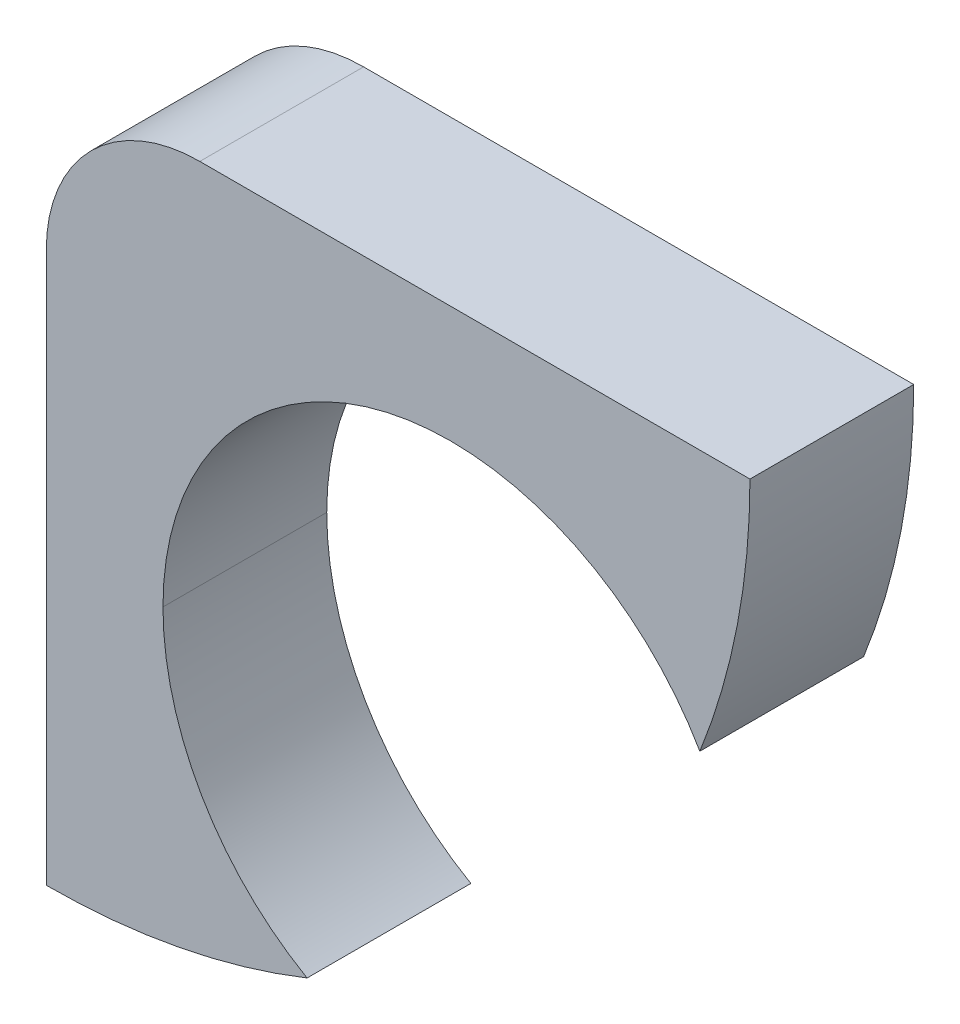
ISO-10303-21;
HEADER;
FILE_DESCRIPTION(('STEP AP214'),'2;1');
FILE_NAME('part.step','',(''),(''),'','','');
FILE_SCHEMA(('AUTOMOTIVE_DESIGN { 1 0 10303 214 1 1 1 1 }'));
ENDSEC;
DATA;
#1=APPLICATION_CONTEXT('core data for automotive mechanical design processes');
#2=APPLICATION_PROTOCOL_DEFINITION('international standard','automotive_design',2000,#1);
#3=PRODUCT_CONTEXT('',#1,'mechanical');
#4=PRODUCT('Part','Part','',(#3));
#5=PRODUCT_RELATED_PRODUCT_CATEGORY('part','',(#4));
#6=PRODUCT_DEFINITION_FORMATION('','',#4);
#7=PRODUCT_DEFINITION_CONTEXT('part definition',#1,'design');
#8=PRODUCT_DEFINITION('design','',#6,#7);
#9=PRODUCT_DEFINITION_SHAPE('','',#8);
#10=(LENGTH_UNIT() NAMED_UNIT(*) SI_UNIT(.MILLI.,.METRE.));
#11=(NAMED_UNIT(*) PLANE_ANGLE_UNIT() SI_UNIT($,.RADIAN.));
#12=(NAMED_UNIT(*) SI_UNIT($,.STERADIAN.) SOLID_ANGLE_UNIT());
#13=UNCERTAINTY_MEASURE_WITH_UNIT(LENGTH_MEASURE(1.E-05),#10,'distance_accuracy_value','');
#14=(GEOMETRIC_REPRESENTATION_CONTEXT(3) GLOBAL_UNCERTAINTY_ASSIGNED_CONTEXT((#13)) GLOBAL_UNIT_ASSIGNED_CONTEXT((#10,
#11,#12)) REPRESENTATION_CONTEXT('',''));
#15=CARTESIAN_POINT('',(0.,0.,0.));
#16=DIRECTION('',(0.,0.,1.));
#17=DIRECTION('',(1.,0.,0.));
#18=AXIS2_PLACEMENT_3D('',#15,#16,#17);
#19=CARTESIAN_POINT('',(-19.95,19.95,18.95));
#20=DIRECTION('',(0.,0.,1.));
#21=DIRECTION('',(1.,0.,0.));
#22=AXIS2_PLACEMENT_3D('',#19,#20,#21);
#23=PLANE('',#22);
#24=CARTESIAN_POINT('',(-19.95,19.95,18.95));
#25=DIRECTION('',(0.,0.,1.));
#26=DIRECTION('',(1.,0.,0.));
#27=AXIS2_PLACEMENT_3D('',#24,#25,#26);
#28=CIRCLE('',#27,6.875);
#29=CARTESIAN_POINT('',(-13.5646574803851,17.4018583423997,18.95));
#30=VERTEX_POINT('',#29);
#31=CARTESIAN_POINT('',(-13.075,19.95,18.95));
#32=VERTEX_POINT('',#31);
#33=EDGE_CURVE('E148',#30,#32,#28,.T.);
#34=ORIENTED_EDGE('',*,*,#33,.F.);
#35=CARTESIAN_POINT('',(-16.,16.,18.95));
#36=DIRECTION('',(0.,0.,-1.));
#37=DIRECTION('',(1.,0.,0.));
#38=AXIS2_PLACEMENT_3D('',#35,#36,#37);
#39=CIRCLE('',#38,2.81);
#40=CARTESIAN_POINT('',(-18.81,16.,18.95));
#41=VERTEX_POINT('',#40);
#42=EDGE_CURVE('E142',#41,#30,#39,.T.);
#43=ORIENTED_EDGE('',*,*,#42,.F.);
#44=CARTESIAN_POINT('',(-16.,16.,18.95));
#45=DIRECTION('',(0.,0.,-1.));
#46=DIRECTION('',(1.,0.,0.));
#47=AXIS2_PLACEMENT_3D('',#44,#45,#46);
#48=CIRCLE('',#47,2.81);
#49=CARTESIAN_POINT('',(-17.4018583423997,13.5646574803851,18.95));
#50=VERTEX_POINT('',#49);
#51=EDGE_CURVE('E11',#50,#41,#48,.T.);
#52=ORIENTED_EDGE('',*,*,#51,.F.);
#53=CARTESIAN_POINT('',(-19.95,19.95,18.95));
#54=DIRECTION('',(0.,0.,1.));
#55=DIRECTION('',(1.,0.,0.));
#56=AXIS2_PLACEMENT_3D('',#53,#54,#55);
#57=CIRCLE('',#56,6.875);
#58=CARTESIAN_POINT('',(-19.95,13.075,18.95));
#59=VERTEX_POINT('',#58);
#60=EDGE_CURVE('E102',#59,#50,#57,.T.);
#61=ORIENTED_EDGE('',*,*,#60,.F.);
#62=DIRECTION('',(0.,-1.,0.));
#63=VECTOR('',#62,1.);
#64=CARTESIAN_POINT('',(-19.95,18.45,18.95));
#65=LINE('',#64,#63);
#66=CARTESIAN_POINT('',(-19.95,18.45,18.95));
#67=VERTEX_POINT('',#66);
#68=EDGE_CURVE('E96',#67,#59,#65,.T.);
#69=ORIENTED_EDGE('',*,*,#68,.F.);
#70=CARTESIAN_POINT('',(-18.45,18.45,18.95));
#71=DIRECTION('',(0.,0.,1.));
#72=DIRECTION('',(1.,0.,0.));
#73=AXIS2_PLACEMENT_3D('',#70,#71,#72);
#74=CIRCLE('',#73,1.5);
#75=CARTESIAN_POINT('',(-18.45,19.95,18.95));
#76=VERTEX_POINT('',#75);
#77=EDGE_CURVE('E99',#76,#67,#74,.T.);
#78=ORIENTED_EDGE('',*,*,#77,.F.);
#79=DIRECTION('',(-1.,0.,0.));
#80=VECTOR('',#79,1.);
#81=CARTESIAN_POINT('',(-13.075,19.95,18.95));
#82=LINE('',#81,#80);
#83=EDGE_CURVE('E20',#32,#76,#82,.T.);
#84=ORIENTED_EDGE('',*,*,#83,.F.);
#85=EDGE_LOOP('',(#34,#43,#52,#61,#69,#78,#84));
#86=FACE_BOUND('',#85,.T.);
#87=ADVANCED_FACE('F16',(#86),#23,.F.);
#88=CARTESIAN_POINT('',(-19.95,19.95,20.55));
#89=DIRECTION('',(0.,0.,1.));
#90=DIRECTION('',(1.,0.,0.));
#91=AXIS2_PLACEMENT_3D('',#88,#89,#90);
#92=PLANE('',#91);
#93=CARTESIAN_POINT('',(-19.95,19.95,20.55));
#94=DIRECTION('',(0.,0.,1.));
#95=DIRECTION('',(1.,0.,0.));
#96=AXIS2_PLACEMENT_3D('',#93,#94,#95);
#97=CIRCLE('',#96,6.875);
#98=CARTESIAN_POINT('',(-13.5646574803851,17.4018583423997,20.55));
#99=VERTEX_POINT('',#98);
#100=CARTESIAN_POINT('',(-13.075,19.95,20.55));
#101=VERTEX_POINT('',#100);
#102=EDGE_CURVE('E158',#99,#101,#97,.T.);
#103=ORIENTED_EDGE('',*,*,#102,.T.);
#104=DIRECTION('',(-1.,0.,0.));
#105=VECTOR('',#104,1.);
#106=CARTESIAN_POINT('',(-13.075,19.95,20.55));
#107=LINE('',#106,#105);
#108=CARTESIAN_POINT('',(-18.45,19.95,20.55));
#109=VERTEX_POINT('',#108);
#110=EDGE_CURVE('E124',#101,#109,#107,.T.);
#111=ORIENTED_EDGE('',*,*,#110,.T.);
#112=CARTESIAN_POINT('',(-18.45,18.45,20.55));
#113=DIRECTION('',(0.,0.,1.));
#114=DIRECTION('',(1.,0.,0.));
#115=AXIS2_PLACEMENT_3D('',#112,#113,#114);
#116=CIRCLE('',#115,1.5);
#117=CARTESIAN_POINT('',(-19.95,18.45,20.55));
#118=VERTEX_POINT('',#117);
#119=EDGE_CURVE('E108',#109,#118,#116,.T.);
#120=ORIENTED_EDGE('',*,*,#119,.T.);
#121=DIRECTION('',(0.,-1.,0.));
#122=VECTOR('',#121,1.);
#123=CARTESIAN_POINT('',(-19.95,18.45,20.55));
#124=LINE('',#123,#122);
#125=CARTESIAN_POINT('',(-19.95,13.075,20.55));
#126=VERTEX_POINT('',#125);
#127=EDGE_CURVE('E114',#118,#126,#124,.T.);
#128=ORIENTED_EDGE('',*,*,#127,.T.);
#129=CARTESIAN_POINT('',(-19.95,19.95,20.55));
#130=DIRECTION('',(0.,0.,1.));
#131=DIRECTION('',(1.,0.,0.));
#132=AXIS2_PLACEMENT_3D('',#129,#130,#131);
#133=CIRCLE('',#132,6.875);
#134=CARTESIAN_POINT('',(-17.4018583423997,13.5646574803851,20.55));
#135=VERTEX_POINT('',#134);
#136=EDGE_CURVE('E135',#126,#135,#133,.T.);
#137=ORIENTED_EDGE('',*,*,#136,.T.);
#138=CARTESIAN_POINT('',(-16.,16.,20.55));
#139=DIRECTION('',(0.,0.,-1.));
#140=DIRECTION('',(1.,0.,0.));
#141=AXIS2_PLACEMENT_3D('',#138,#139,#140);
#142=CIRCLE('',#141,2.81);
#143=CARTESIAN_POINT('',(-18.81,16.,20.55));
#144=VERTEX_POINT('',#143);
#145=EDGE_CURVE('E26',#135,#144,#142,.T.);
#146=ORIENTED_EDGE('',*,*,#145,.T.);
#147=CARTESIAN_POINT('',(-16.,16.,20.55));
#148=DIRECTION('',(0.,0.,-1.));
#149=DIRECTION('',(1.,0.,0.));
#150=AXIS2_PLACEMENT_3D('',#147,#148,#149);
#151=CIRCLE('',#150,2.81);
#152=EDGE_CURVE('E143',#144,#99,#151,.T.);
#153=ORIENTED_EDGE('',*,*,#152,.T.);
#154=EDGE_LOOP('',(#103,#111,#120,#128,#137,#146,#153));
#155=FACE_BOUND('',#154,.T.);
#156=ADVANCED_FACE('F181',(#155),#92,.T.);
#157=CARTESIAN_POINT('',(-16.,16.,20.55));
#158=DIRECTION('',(0.,0.,-1.));
#159=DIRECTION('',(-1.,0.,0.));
#160=AXIS2_PLACEMENT_3D('',#157,#158,#159);
#161=CYLINDRICAL_SURFACE('',#160,2.81);
#162=DIRECTION('',(0.,0.,-1.));
#163=VECTOR('',#162,1.);
#164=CARTESIAN_POINT('',(-18.81,16.,20.55));
#165=LINE('',#164,#163);
#166=EDGE_CURVE('E138',#144,#41,#165,.T.);
#167=ORIENTED_EDGE('',*,*,#166,.F.);
#168=ORIENTED_EDGE('',*,*,#145,.F.);
#169=DIRECTION('',(0.,0.,-1.));
#170=VECTOR('',#169,1.);
#171=CARTESIAN_POINT('',(-17.4018583423997,13.5646574803851,20.55));
#172=LINE('',#171,#170);
#173=EDGE_CURVE('E133',#135,#50,#172,.T.);
#174=ORIENTED_EDGE('',*,*,#173,.T.);
#175=ORIENTED_EDGE('',*,*,#51,.T.);
#176=EDGE_LOOP('',(#167,#168,#174,#175));
#177=FACE_BOUND('',#176,.T.);
#178=ADVANCED_FACE('F192',(#177),#161,.F.);
#179=CARTESIAN_POINT('',(-19.95,19.95,20.55));
#180=DIRECTION('',(0.,0.,-1.));
#181=DIRECTION('',(-1.,0.,0.));
#182=AXIS2_PLACEMENT_3D('',#179,#180,#181);
#183=CYLINDRICAL_SURFACE('',#182,6.875);
#184=ORIENTED_EDGE('',*,*,#60,.T.);
#185=ORIENTED_EDGE('',*,*,#173,.F.);
#186=ORIENTED_EDGE('',*,*,#136,.F.);
#187=DIRECTION('',(0.,0.,-1.));
#188=VECTOR('',#187,1.);
#189=CARTESIAN_POINT('',(-19.95,13.075,20.55));
#190=LINE('',#189,#188);
#191=EDGE_CURVE('E107',#126,#59,#190,.T.);
#192=ORIENTED_EDGE('',*,*,#191,.T.);
#193=EDGE_LOOP('',(#184,#185,#186,#192));
#194=FACE_BOUND('',#193,.T.);
#195=ADVANCED_FACE('F191',(#194),#183,.T.);
#196=CARTESIAN_POINT('',(-19.95,18.45,20.55));
#197=DIRECTION('',(1.,0.,0.));
#198=DIRECTION('',(0.,1.,0.));
#199=AXIS2_PLACEMENT_3D('',#196,#197,#198);
#200=PLANE('',#199);
#201=ORIENTED_EDGE('',*,*,#68,.T.);
#202=ORIENTED_EDGE('',*,*,#191,.F.);
#203=ORIENTED_EDGE('',*,*,#127,.F.);
#204=DIRECTION('',(0.,0.,-1.));
#205=VECTOR('',#204,1.);
#206=CARTESIAN_POINT('',(-19.95,18.45,20.55));
#207=LINE('',#206,#205);
#208=EDGE_CURVE('E111',#118,#67,#207,.T.);
#209=ORIENTED_EDGE('',*,*,#208,.T.);
#210=EDGE_LOOP('',(#201,#202,#203,#209));
#211=FACE_BOUND('',#210,.T.);
#212=ADVANCED_FACE('F112',(#211),#200,.F.);
#213=CARTESIAN_POINT('',(-18.45,18.45,20.55));
#214=DIRECTION('',(0.,0.,-1.));
#215=DIRECTION('',(-1.,0.,0.));
#216=AXIS2_PLACEMENT_3D('',#213,#214,#215);
#217=CYLINDRICAL_SURFACE('',#216,1.5);
#218=ORIENTED_EDGE('',*,*,#77,.T.);
#219=ORIENTED_EDGE('',*,*,#208,.F.);
#220=ORIENTED_EDGE('',*,*,#119,.F.);
#221=DIRECTION('',(0.,0.,-1.));
#222=VECTOR('',#221,1.);
#223=CARTESIAN_POINT('',(-18.45,19.95,20.55));
#224=LINE('',#223,#222);
#225=EDGE_CURVE('E121',#109,#76,#224,.T.);
#226=ORIENTED_EDGE('',*,*,#225,.T.);
#227=EDGE_LOOP('',(#218,#219,#220,#226));
#228=FACE_BOUND('',#227,.T.);
#229=ADVANCED_FACE('F119',(#228),#217,.T.);
#230=CARTESIAN_POINT('',(-13.075,19.95,20.55));
#231=DIRECTION('',(0.,-1.,0.));
#232=DIRECTION('',(0.,0.,-1.));
#233=AXIS2_PLACEMENT_3D('',#230,#231,#232);
#234=PLANE('',#233);
#235=ORIENTED_EDGE('',*,*,#83,.T.);
#236=ORIENTED_EDGE('',*,*,#225,.F.);
#237=ORIENTED_EDGE('',*,*,#110,.F.);
#238=DIRECTION('',(0.,0.,-1.));
#239=VECTOR('',#238,1.);
#240=CARTESIAN_POINT('',(-13.075,19.95,20.55));
#241=LINE('',#240,#239);
#242=EDGE_CURVE('E154',#101,#32,#241,.T.);
#243=ORIENTED_EDGE('',*,*,#242,.T.);
#244=EDGE_LOOP('',(#235,#236,#237,#243));
#245=FACE_BOUND('',#244,.T.);
#246=ADVANCED_FACE('F18',(#245),#234,.F.);
#247=CARTESIAN_POINT('',(-19.95,19.95,20.55));
#248=DIRECTION('',(0.,0.,-1.));
#249=DIRECTION('',(-1.,0.,0.));
#250=AXIS2_PLACEMENT_3D('',#247,#248,#249);
#251=CYLINDRICAL_SURFACE('',#250,6.875);
#252=ORIENTED_EDGE('',*,*,#33,.T.);
#253=ORIENTED_EDGE('',*,*,#242,.F.);
#254=ORIENTED_EDGE('',*,*,#102,.F.);
#255=DIRECTION('',(0.,0.,-1.));
#256=VECTOR('',#255,1.);
#257=CARTESIAN_POINT('',(-13.5646574803851,17.4018583423997,20.55));
#258=LINE('',#257,#256);
#259=EDGE_CURVE('E144',#99,#30,#258,.T.);
#260=ORIENTED_EDGE('',*,*,#259,.T.);
#261=EDGE_LOOP('',(#252,#253,#254,#260));
#262=FACE_BOUND('',#261,.T.);
#263=ADVANCED_FACE('F187',(#262),#251,.T.);
#264=CARTESIAN_POINT('',(-16.,16.,20.55));
#265=DIRECTION('',(0.,0.,-1.));
#266=DIRECTION('',(-1.,0.,0.));
#267=AXIS2_PLACEMENT_3D('',#264,#265,#266);
#268=CYLINDRICAL_SURFACE('',#267,2.81);
#269=ORIENTED_EDGE('',*,*,#152,.F.);
#270=ORIENTED_EDGE('',*,*,#166,.T.);
#271=ORIENTED_EDGE('',*,*,#42,.T.);
#272=ORIENTED_EDGE('',*,*,#259,.F.);
#273=EDGE_LOOP('',(#269,#270,#271,#272));
#274=FACE_BOUND('',#273,.T.);
#275=ADVANCED_FACE('F185',(#274),#268,.F.);
#276=CLOSED_SHELL('',(#87,#156,#178,#195,#212,#229,#246,#263,#275));
#277=MANIFOLD_SOLID_BREP('B1',#276);
#278=ADVANCED_BREP_SHAPE_REPRESENTATION('',(#18,#277),#14);
#279=SHAPE_DEFINITION_REPRESENTATION(#9,#278);
ENDSEC;
END-ISO-10303-21;
